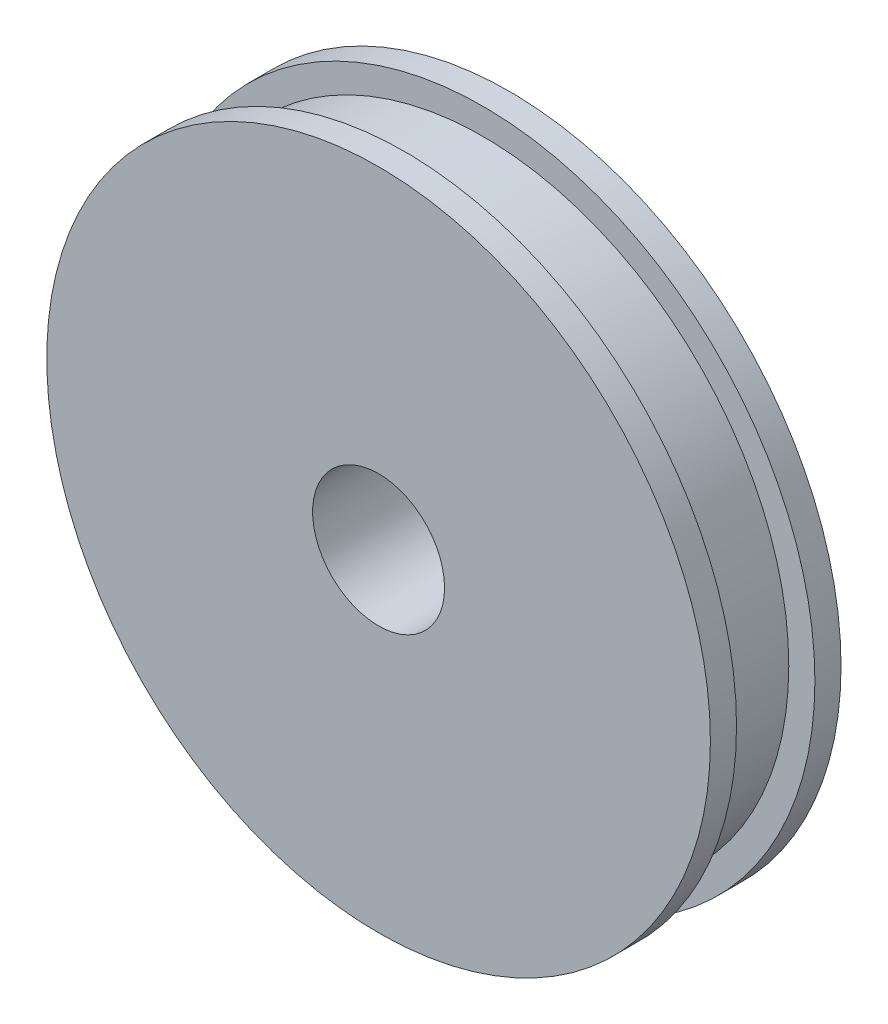
ISO-10303-21;
HEADER;
FILE_DESCRIPTION(('STEP AP214'),'2;1');
FILE_NAME('part.step','',(''),(''),'','','');
FILE_SCHEMA(('AUTOMOTIVE_DESIGN { 1 0 10303 214 1 1 1 1 }'));
ENDSEC;
DATA;
#1=APPLICATION_CONTEXT('core data for automotive mechanical design processes');
#2=APPLICATION_PROTOCOL_DEFINITION('international standard','automotive_design',2000,#1);
#3=PRODUCT_CONTEXT('',#1,'mechanical');
#4=PRODUCT('Part','Part','',(#3));
#5=PRODUCT_RELATED_PRODUCT_CATEGORY('part','',(#4));
#6=PRODUCT_DEFINITION_FORMATION('','',#4);
#7=PRODUCT_DEFINITION_CONTEXT('part definition',#1,'design');
#8=PRODUCT_DEFINITION('design','',#6,#7);
#9=PRODUCT_DEFINITION_SHAPE('','',#8);
#10=(LENGTH_UNIT() NAMED_UNIT(*) SI_UNIT(.MILLI.,.METRE.));
#11=(NAMED_UNIT(*) PLANE_ANGLE_UNIT() SI_UNIT($,.RADIAN.));
#12=(NAMED_UNIT(*) SI_UNIT($,.STERADIAN.) SOLID_ANGLE_UNIT());
#13=UNCERTAINTY_MEASURE_WITH_UNIT(LENGTH_MEASURE(1.E-05),#10,'distance_accuracy_value','');
#14=(GEOMETRIC_REPRESENTATION_CONTEXT(3) GLOBAL_UNCERTAINTY_ASSIGNED_CONTEXT((#13)) GLOBAL_UNIT_ASSIGNED_CONTEXT((#10,
#11,#12)) REPRESENTATION_CONTEXT('',''));
#15=CARTESIAN_POINT('',(0.,0.,0.));
#16=DIRECTION('',(0.,0.,1.));
#17=DIRECTION('',(1.,0.,0.));
#18=AXIS2_PLACEMENT_3D('',#15,#16,#17);
#19=CARTESIAN_POINT('',(0.,0.,10.));
#20=DIRECTION('',(0.,0.,-1.));
#21=DIRECTION('',(-1.,0.,0.));
#22=AXIS2_PLACEMENT_3D('',#19,#20,#21);
#23=CYLINDRICAL_SURFACE('',#22,25.4);
#24=CARTESIAN_POINT('',(0.,0.,0.));
#25=DIRECTION('',(0.,0.,1.));
#26=DIRECTION('',(1.,0.,0.));
#27=AXIS2_PLACEMENT_3D('',#24,#25,#26);
#28=CIRCLE('',#27,25.4);
#29=CARTESIAN_POINT('',(25.4,0.,0.));
#30=VERTEX_POINT('',#29);
#31=EDGE_CURVE('E35',#30,#30,#28,.T.);
#32=ORIENTED_EDGE('',*,*,#31,.T.);
#33=EDGE_LOOP('',(#32));
#34=FACE_BOUND('',#33,.T.);
#35=CARTESIAN_POINT('',(0.,0.,2.));
#36=DIRECTION('',(0.,0.,1.));
#37=DIRECTION('',(1.,0.,0.));
#38=AXIS2_PLACEMENT_3D('',#35,#36,#37);
#39=CIRCLE('',#38,25.4);
#40=CARTESIAN_POINT('',(25.4,0.,2.));
#41=VERTEX_POINT('',#40);
#42=EDGE_CURVE('E58',#41,#41,#39,.T.);
#43=ORIENTED_EDGE('',*,*,#42,.F.);
#44=EDGE_LOOP('',(#43));
#45=FACE_BOUND('',#44,.T.);
#46=ADVANCED_FACE('F32',(#34,#45),#23,.T.);
#47=CARTESIAN_POINT('',(0.,0.,10.));
#48=DIRECTION('',(0.,0.,1.));
#49=DIRECTION('',(1.,0.,0.));
#50=AXIS2_PLACEMENT_3D('',#47,#48,#49);
#51=CIRCLE('',#50,25.4);
#52=CARTESIAN_POINT('',(25.4,0.,10.));
#53=VERTEX_POINT('',#52);
#54=EDGE_CURVE('E10',#53,#53,#51,.T.);
#55=ORIENTED_EDGE('',*,*,#54,.F.);
#56=EDGE_LOOP('',(#55));
#57=FACE_BOUND('',#56,.T.);
#58=CARTESIAN_POINT('',(0.,0.,8.));
#59=DIRECTION('',(0.,0.,1.));
#60=DIRECTION('',(1.,0.,0.));
#61=AXIS2_PLACEMENT_3D('',#58,#59,#60);
#62=CIRCLE('',#61,25.4);
#63=CARTESIAN_POINT('',(25.4,0.,8.));
#64=VERTEX_POINT('',#63);
#65=EDGE_CURVE('E55',#64,#64,#62,.T.);
#66=ORIENTED_EDGE('',*,*,#65,.T.);
#67=EDGE_LOOP('',(#66));
#68=FACE_BOUND('',#67,.T.);
#69=ADVANCED_FACE('F66',(#57,#68),#23,.T.);
#70=CARTESIAN_POINT('',(0.,0.,10.));
#71=DIRECTION('',(0.,0.,1.));
#72=DIRECTION('',(1.,0.,0.));
#73=AXIS2_PLACEMENT_3D('',#70,#71,#72);
#74=PLANE('',#73);
#75=ORIENTED_EDGE('',*,*,#54,.T.);
#76=EDGE_LOOP('',(#75));
#77=FACE_BOUND('',#76,.T.);
#78=CARTESIAN_POINT('',(0.,0.,10.));
#79=DIRECTION('',(0.,0.,1.));
#80=DIRECTION('',(1.,0.,0.));
#81=AXIS2_PLACEMENT_3D('',#78,#79,#80);
#82=CIRCLE('',#81,5.05);
#83=CARTESIAN_POINT('',(5.05,0.,10.));
#84=VERTEX_POINT('',#83);
#85=EDGE_CURVE('E42',#84,#84,#82,.T.);
#86=ORIENTED_EDGE('',*,*,#85,.F.);
#87=EDGE_LOOP('',(#86));
#88=FACE_BOUND('',#87,.T.);
#89=ADVANCED_FACE('F71',(#77,#88),#74,.T.);
#90=CARTESIAN_POINT('',(0.,0.,0.));
#91=DIRECTION('',(0.,0.,1.));
#92=DIRECTION('',(1.,0.,0.));
#93=AXIS2_PLACEMENT_3D('',#90,#91,#92);
#94=PLANE('',#93);
#95=ORIENTED_EDGE('',*,*,#31,.F.);
#96=EDGE_LOOP('',(#95));
#97=FACE_BOUND('',#96,.T.);
#98=CARTESIAN_POINT('',(0.,0.,0.));
#99=DIRECTION('',(0.,0.,1.));
#100=DIRECTION('',(1.,0.,0.));
#101=AXIS2_PLACEMENT_3D('',#98,#99,#100);
#102=CIRCLE('',#101,5.05);
#103=CARTESIAN_POINT('',(5.05,0.,0.));
#104=VERTEX_POINT('',#103);
#105=EDGE_CURVE('E44',#104,#104,#102,.T.);
#106=ORIENTED_EDGE('',*,*,#105,.T.);
#107=EDGE_LOOP('',(#106));
#108=FACE_BOUND('',#107,.T.);
#109=ADVANCED_FACE('F75',(#97,#108),#94,.F.);
#110=CARTESIAN_POINT('',(0.,0.,10.));
#111=DIRECTION('',(0.,0.,-1.));
#112=DIRECTION('',(-1.,0.,0.));
#113=AXIS2_PLACEMENT_3D('',#110,#111,#112);
#114=CYLINDRICAL_SURFACE('',#113,5.05);
#115=ORIENTED_EDGE('',*,*,#85,.T.);
#116=EDGE_LOOP('',(#115));
#117=FACE_BOUND('',#116,.T.);
#118=ORIENTED_EDGE('',*,*,#105,.F.);
#119=EDGE_LOOP('',(#118));
#120=FACE_BOUND('',#119,.T.);
#121=ADVANCED_FACE('F78',(#117,#120),#114,.F.);
#122=CARTESIAN_POINT('',(0.,25.4,2.));
#123=DIRECTION('',(0.,0.,1.));
#124=DIRECTION('',(1.,0.,0.));
#125=AXIS2_PLACEMENT_3D('',#122,#123,#124);
#126=PLANE('',#125);
#127=ORIENTED_EDGE('',*,*,#42,.T.);
#128=EDGE_LOOP('',(#127));
#129=FACE_BOUND('',#128,.T.);
#130=CARTESIAN_POINT('',(0.,0.,2.));
#131=DIRECTION('',(0.,0.,1.));
#132=DIRECTION('',(1.,0.,0.));
#133=AXIS2_PLACEMENT_3D('',#130,#131,#132);
#134=CIRCLE('',#133,23.4);
#135=CARTESIAN_POINT('',(23.4,0.,2.));
#136=VERTEX_POINT('',#135);
#137=EDGE_CURVE('E47',#136,#136,#134,.T.);
#138=ORIENTED_EDGE('',*,*,#137,.F.);
#139=EDGE_LOOP('',(#138));
#140=FACE_BOUND('',#139,.T.);
#141=ADVANCED_FACE('F62',(#129,#140),#126,.T.);
#142=CARTESIAN_POINT('',(0.,0.,10.));
#143=DIRECTION('',(0.,0.,1.));
#144=DIRECTION('',(1.,0.,0.));
#145=AXIS2_PLACEMENT_3D('',#142,#143,#144);
#146=CYLINDRICAL_SURFACE('',#145,23.4);
#147=ORIENTED_EDGE('',*,*,#137,.T.);
#148=EDGE_LOOP('',(#147));
#149=FACE_BOUND('',#148,.T.);
#150=CARTESIAN_POINT('',(0.,0.,8.));
#151=DIRECTION('',(0.,0.,1.));
#152=DIRECTION('',(1.,0.,0.));
#153=AXIS2_PLACEMENT_3D('',#150,#151,#152);
#154=CIRCLE('',#153,23.4);
#155=CARTESIAN_POINT('',(23.4,0.,8.));
#156=VERTEX_POINT('',#155);
#157=EDGE_CURVE('E52',#156,#156,#154,.T.);
#158=ORIENTED_EDGE('',*,*,#157,.F.);
#159=EDGE_LOOP('',(#158));
#160=FACE_BOUND('',#159,.T.);
#161=ADVANCED_FACE('F87',(#149,#160),#146,.T.);
#162=CARTESIAN_POINT('',(0.,25.4,8.));
#163=DIRECTION('',(0.,0.,-1.));
#164=DIRECTION('',(-1.,0.,0.));
#165=AXIS2_PLACEMENT_3D('',#162,#163,#164);
#166=PLANE('',#165);
#167=ORIENTED_EDGE('',*,*,#157,.T.);
#168=EDGE_LOOP('',(#167));
#169=FACE_BOUND('',#168,.T.);
#170=ORIENTED_EDGE('',*,*,#65,.F.);
#171=EDGE_LOOP('',(#170));
#172=FACE_BOUND('',#171,.T.);
#173=ADVANCED_FACE('F129',(#169,#172),#166,.T.);
#174=CLOSED_SHELL('',(#46,#69,#89,#109,#121,#141,#161,#173));
#175=MANIFOLD_SOLID_BREP('B2',#174);
#176=ADVANCED_BREP_SHAPE_REPRESENTATION('',(#18,#175),#14);
#177=SHAPE_DEFINITION_REPRESENTATION(#9,#176);
ENDSEC;
END-ISO-10303-21;
